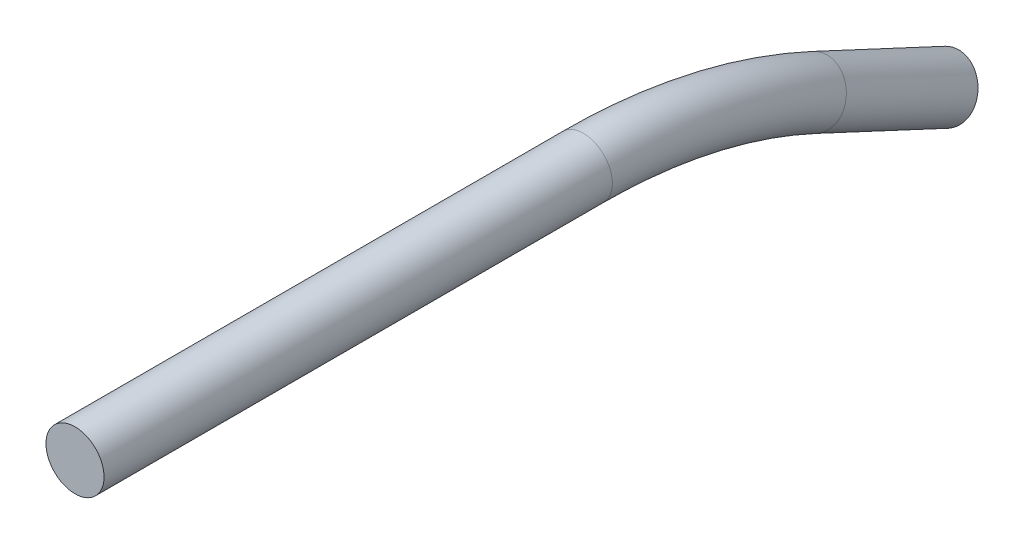
ISO-10303-21;
HEADER;
FILE_DESCRIPTION(('STEP AP214'),'2;1');
FILE_NAME('part.step','',(''),(''),'','','');
FILE_SCHEMA(('AUTOMOTIVE_DESIGN { 1 0 10303 214 1 1 1 1 }'));
ENDSEC;
DATA;
#1=APPLICATION_CONTEXT('core data for automotive mechanical design processes');
#2=APPLICATION_PROTOCOL_DEFINITION('international standard','automotive_design',2000,#1);
#3=PRODUCT_CONTEXT('',#1,'mechanical');
#4=PRODUCT('Part','Part','',(#3));
#5=PRODUCT_RELATED_PRODUCT_CATEGORY('part','',(#4));
#6=PRODUCT_DEFINITION_FORMATION('','',#4);
#7=PRODUCT_DEFINITION_CONTEXT('part definition',#1,'design');
#8=PRODUCT_DEFINITION('design','',#6,#7);
#9=PRODUCT_DEFINITION_SHAPE('','',#8);
#10=(LENGTH_UNIT() NAMED_UNIT(*) SI_UNIT(.MILLI.,.METRE.));
#11=(NAMED_UNIT(*) PLANE_ANGLE_UNIT() SI_UNIT($,.RADIAN.));
#12=(NAMED_UNIT(*) SI_UNIT($,.STERADIAN.) SOLID_ANGLE_UNIT());
#13=UNCERTAINTY_MEASURE_WITH_UNIT(LENGTH_MEASURE(1.E-05),#10,'distance_accuracy_value','');
#14=(GEOMETRIC_REPRESENTATION_CONTEXT(3) GLOBAL_UNCERTAINTY_ASSIGNED_CONTEXT((#13)) GLOBAL_UNIT_ASSIGNED_CONTEXT((#10,
#11,#12)) REPRESENTATION_CONTEXT('',''));
#15=CARTESIAN_POINT('',(0.,0.,0.));
#16=DIRECTION('',(0.,0.,1.));
#17=DIRECTION('',(1.,0.,0.));
#18=AXIS2_PLACEMENT_3D('',#15,#16,#17);
#19=CARTESIAN_POINT('',(10.326,-3.999,-6.02));
#20=DIRECTION('',(0.,0.,1.));
#21=DIRECTION('',(-1.,0.,0.));
#22=AXIS2_PLACEMENT_3D('',#19,#20,#21);
#23=PLANE('',#22);
#24=CARTESIAN_POINT('',(10.125,-4.2,-6.02));
#25=DIRECTION('',(0.,0.,1.));
#26=DIRECTION('',(1.,0.,0.));
#27=AXIS2_PLACEMENT_3D('',#24,#25,#26);
#28=CIRCLE('',#27,0.2);
#29=CARTESIAN_POINT('',(10.325,-4.2,-6.02));
#30=VERTEX_POINT('',#29);
#31=EDGE_CURVE('E31',#30,#30,#28,.F.);
#32=ORIENTED_EDGE('',*,*,#31,.F.);
#33=EDGE_LOOP('',(#32));
#34=FACE_BOUND('',#33,.T.);
#35=ADVANCED_FACE('F15',(#34),#23,.T.);
#36=CARTESIAN_POINT('',(10.125,-4.2,-9.52));
#37=DIRECTION('',(0.,0.,1.));
#38=DIRECTION('',(1.,0.,0.));
#39=AXIS2_PLACEMENT_3D('',#36,#37,#38);
#40=CYLINDRICAL_SURFACE('',#39,0.2);
#41=ORIENTED_EDGE('',*,*,#31,.T.);
#42=EDGE_LOOP('',(#41));
#43=FACE_BOUND('',#42,.T.);
#44=CARTESIAN_POINT('',(10.125,-4.2,-9.52));
#45=DIRECTION('',(0.,0.,-1.));
#46=DIRECTION('',(-1.,0.,0.));
#47=AXIS2_PLACEMENT_3D('',#44,#45,#46);
#48=CIRCLE('',#47,0.2);
#49=CARTESIAN_POINT('',(9.925,-4.2,-9.52));
#50=VERTEX_POINT('',#49);
#51=EDGE_CURVE('E28',#50,#50,#48,.T.);
#52=ORIENTED_EDGE('',*,*,#51,.F.);
#53=EDGE_LOOP('',(#52));
#54=FACE_BOUND('',#53,.T.);
#55=ADVANCED_FACE('F38',(#43,#54),#40,.T.);
#56=CARTESIAN_POINT('',(9.924,-4.79376345405194,-12.104946270602));
#57=DIRECTION('',(0.,-0.422618261741009,-0.906307787036506));
#58=DIRECTION('',(1.,0.,0.));
#59=AXIS2_PLACEMENT_3D('',#56,#57,#58);
#60=PLANE('',#59);
#61=CARTESIAN_POINT('',(10.125,-4.97593131923963,-12.0199999999952));
#62=DIRECTION('',(0.,0.422618261740962,0.906307787036527));
#63=DIRECTION('',(0.,-0.906307787036527,0.422618261740962));
#64=AXIS2_PLACEMENT_3D('',#61,#62,#63);
#65=CIRCLE('',#64,0.200000000000008);
#66=CARTESIAN_POINT('',(10.125,-5.15719287664694,-11.935476347647));
#67=VERTEX_POINT('',#66);
#68=EDGE_CURVE('E23',#67,#67,#65,.T.);
#69=ORIENTED_EDGE('',*,*,#68,.F.);
#70=EDGE_LOOP('',(#69));
#71=FACE_BOUND('',#70,.T.);
#72=ADVANCED_FACE('F40',(#71),#60,.T.);
#73=CARTESIAN_POINT('',(10.125,-7.97099703729429,-9.52000000001683));
#74=DIRECTION('',(1.,0.,0.));
#75=DIRECTION('',(0.,1.,0.));
#76=AXIS2_PLACEMENT_3D('',#73,#74,#75);
#77=TOROIDAL_SURFACE('',#76,3.77099703729429,0.200000000000008);
#78=CARTESIAN_POINT('',(10.125,-4.55331305751668,-11.1136922129969));
#79=DIRECTION('',(0.,-0.422618261740942,-0.906307787036537));
#80=DIRECTION('',(0.,0.906307787036537,-0.422618261740942));
#81=AXIS2_PLACEMENT_3D('',#78,#79,#80);
#82=CIRCLE('',#81,0.200000000000007);
#83=CARTESIAN_POINT('',(10.125,-4.37205150010937,-11.1982158653451));
#84=VERTEX_POINT('',#83);
#85=EDGE_CURVE('E10',#84,#84,#82,.T.);
#86=ORIENTED_EDGE('',*,*,#85,.F.);
#87=EDGE_LOOP('',(#86));
#88=FACE_BOUND('',#87,.T.);
#89=ORIENTED_EDGE('',*,*,#51,.T.);
#90=EDGE_LOOP('',(#89));
#91=FACE_BOUND('',#90,.T.);
#92=ADVANCED_FACE('F36',(#88,#91),#77,.T.);
#93=CARTESIAN_POINT('',(10.125,-4.97593131924333,-12.0200000000031));
#94=DIRECTION('',(0.,0.422618261740962,0.906307787036527));
#95=DIRECTION('',(0.,-0.906307787036527,0.422618261740962));
#96=AXIS2_PLACEMENT_3D('',#93,#94,#95);
#97=CYLINDRICAL_SURFACE('',#96,0.200000000000008);
#98=ORIENTED_EDGE('',*,*,#85,.T.);
#99=EDGE_LOOP('',(#98));
#100=FACE_BOUND('',#99,.T.);
#101=ORIENTED_EDGE('',*,*,#68,.T.);
#102=EDGE_LOOP('',(#101));
#103=FACE_BOUND('',#102,.T.);
#104=ADVANCED_FACE('F17',(#100,#103),#97,.T.);
#105=CLOSED_SHELL('',(#35,#55,#72,#92,#104));
#106=MANIFOLD_SOLID_BREP('B1',#105);
#107=ADVANCED_BREP_SHAPE_REPRESENTATION('',(#18,#106),#14);
#108=SHAPE_DEFINITION_REPRESENTATION(#9,#107);
ENDSEC;
END-ISO-10303-21;
